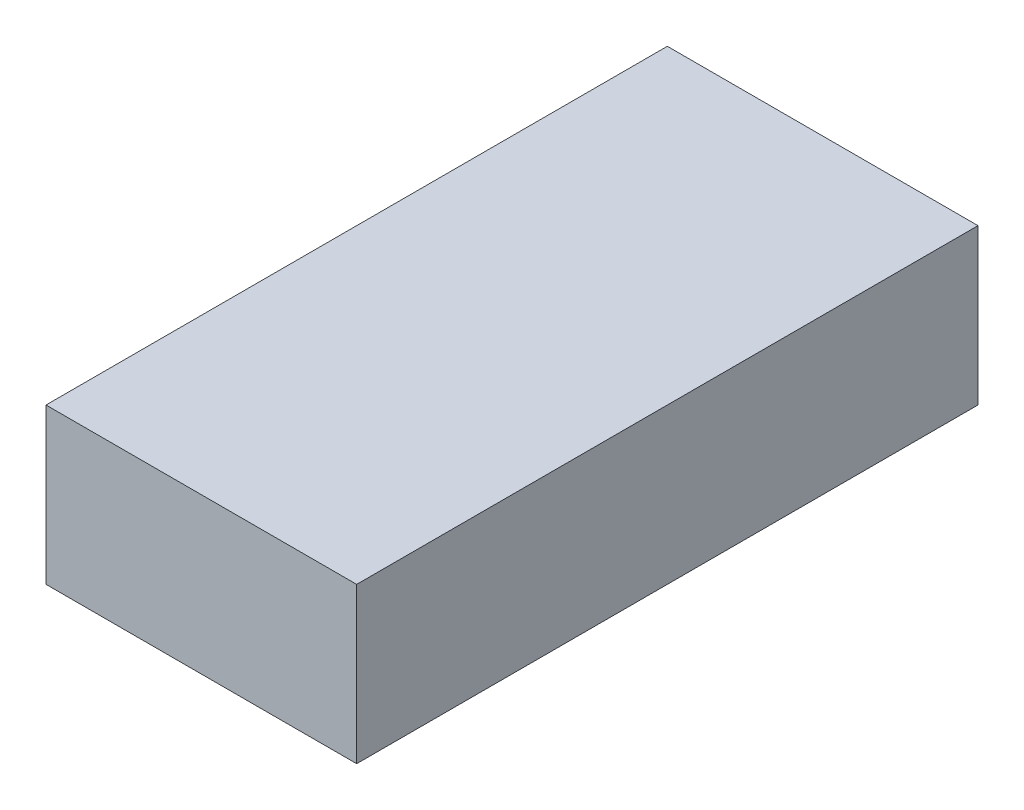
ISO-10303-21;
HEADER;
FILE_DESCRIPTION(('STEP AP214'),'2;1');
FILE_NAME('part.step','',(''),(''),'','','');
FILE_SCHEMA(('AUTOMOTIVE_DESIGN { 1 0 10303 214 1 1 1 1 }'));
ENDSEC;
DATA;
#1=APPLICATION_CONTEXT('core data for automotive mechanical design processes');
#2=APPLICATION_PROTOCOL_DEFINITION('international standard','automotive_design',2000,#1);
#3=PRODUCT_CONTEXT('',#1,'mechanical');
#4=PRODUCT('Part','Part','',(#3));
#5=PRODUCT_RELATED_PRODUCT_CATEGORY('part','',(#4));
#6=PRODUCT_DEFINITION_FORMATION('','',#4);
#7=PRODUCT_DEFINITION_CONTEXT('part definition',#1,'design');
#8=PRODUCT_DEFINITION('design','',#6,#7);
#9=PRODUCT_DEFINITION_SHAPE('','',#8);
#10=(LENGTH_UNIT() NAMED_UNIT(*) SI_UNIT(.MILLI.,.METRE.));
#11=(NAMED_UNIT(*) PLANE_ANGLE_UNIT() SI_UNIT($,.RADIAN.));
#12=(NAMED_UNIT(*) SI_UNIT($,.STERADIAN.) SOLID_ANGLE_UNIT());
#13=UNCERTAINTY_MEASURE_WITH_UNIT(LENGTH_MEASURE(1.E-05),#10,'distance_accuracy_value','');
#14=(GEOMETRIC_REPRESENTATION_CONTEXT(3) GLOBAL_UNCERTAINTY_ASSIGNED_CONTEXT((#13)) GLOBAL_UNIT_ASSIGNED_CONTEXT((#10,
#11,#12)) REPRESENTATION_CONTEXT('',''));
#15=CARTESIAN_POINT('',(0.,0.,0.));
#16=DIRECTION('',(0.,0.,1.));
#17=DIRECTION('',(1.,0.,0.));
#18=AXIS2_PLACEMENT_3D('',#15,#16,#17);
#19=CARTESIAN_POINT('',(0.,152.4,0.));
#20=DIRECTION('',(1.,0.,0.));
#21=DIRECTION('',(0.,0.,-1.));
#22=AXIS2_PLACEMENT_3D('',#19,#20,#21);
#23=PLANE('',#22);
#24=DIRECTION('',(0.,0.,1.));
#25=VECTOR('',#24,1.);
#26=CARTESIAN_POINT('',(0.,0.,0.));
#27=LINE('',#26,#25);
#28=CARTESIAN_POINT('',(0.,0.,-609.6));
#29=VERTEX_POINT('',#28);
#30=CARTESIAN_POINT('',(0.,0.,0.));
#31=VERTEX_POINT('',#30);
#32=EDGE_CURVE('E96',#29,#31,#27,.T.);
#33=ORIENTED_EDGE('',*,*,#32,.T.);
#34=DIRECTION('',(0.,-1.,0.));
#35=VECTOR('',#34,1.);
#36=CARTESIAN_POINT('',(0.,152.4,0.));
#37=LINE('',#36,#35);
#38=CARTESIAN_POINT('',(0.,152.4,0.));
#39=VERTEX_POINT('',#38);
#40=EDGE_CURVE('E11',#39,#31,#37,.T.);
#41=ORIENTED_EDGE('',*,*,#40,.F.);
#42=DIRECTION('',(0.,0.,1.));
#43=VECTOR('',#42,1.);
#44=CARTESIAN_POINT('',(0.,152.4,0.));
#45=LINE('',#44,#43);
#46=CARTESIAN_POINT('',(0.,152.4,-609.6));
#47=VERTEX_POINT('',#46);
#48=EDGE_CURVE('E84',#47,#39,#45,.T.);
#49=ORIENTED_EDGE('',*,*,#48,.F.);
#50=DIRECTION('',(0.,-1.,0.));
#51=VECTOR('',#50,1.);
#52=CARTESIAN_POINT('',(0.,152.4,-609.6));
#53=LINE('',#52,#51);
#54=EDGE_CURVE('E92',#47,#29,#53,.T.);
#55=ORIENTED_EDGE('',*,*,#54,.T.);
#56=EDGE_LOOP('',(#33,#41,#49,#55));
#57=FACE_BOUND('',#56,.T.);
#58=ADVANCED_FACE('F33',(#57),#23,.F.);
#59=CARTESIAN_POINT('',(0.,152.4,0.));
#60=DIRECTION('',(0.,0.,-1.));
#61=DIRECTION('',(-1.,0.,0.));
#62=AXIS2_PLACEMENT_3D('',#59,#60,#61);
#63=PLANE('',#62);
#64=DIRECTION('',(1.,0.,0.));
#65=VECTOR('',#64,1.);
#66=CARTESIAN_POINT('',(0.,0.,0.));
#67=LINE('',#66,#65);
#68=CARTESIAN_POINT('',(304.8,0.,0.));
#69=VERTEX_POINT('',#68);
#70=EDGE_CURVE('E88',#31,#69,#67,.T.);
#71=ORIENTED_EDGE('',*,*,#70,.T.);
#72=DIRECTION('',(0.,-1.,0.));
#73=VECTOR('',#72,1.);
#74=CARTESIAN_POINT('',(304.8,152.4,0.));
#75=LINE('',#74,#73);
#76=CARTESIAN_POINT('',(304.8,152.4,0.));
#77=VERTEX_POINT('',#76);
#78=EDGE_CURVE('E41',#77,#69,#75,.T.);
#79=ORIENTED_EDGE('',*,*,#78,.F.);
#80=DIRECTION('',(1.,0.,0.));
#81=VECTOR('',#80,1.);
#82=CARTESIAN_POINT('',(0.,152.4,0.));
#83=LINE('',#82,#81);
#84=EDGE_CURVE('E79',#39,#77,#83,.T.);
#85=ORIENTED_EDGE('',*,*,#84,.F.);
#86=ORIENTED_EDGE('',*,*,#40,.T.);
#87=EDGE_LOOP('',(#71,#79,#85,#86));
#88=FACE_BOUND('',#87,.T.);
#89=ADVANCED_FACE('F87',(#88),#63,.F.);
#90=CARTESIAN_POINT('',(304.8,152.4,0.));
#91=DIRECTION('',(-1.,0.,0.));
#92=DIRECTION('',(0.,0.,1.));
#93=AXIS2_PLACEMENT_3D('',#90,#91,#92);
#94=PLANE('',#93);
#95=DIRECTION('',(0.,0.,-1.));
#96=VECTOR('',#95,1.);
#97=CARTESIAN_POINT('',(304.8,0.,0.));
#98=LINE('',#97,#96);
#99=CARTESIAN_POINT('',(304.8,0.,-609.6));
#100=VERTEX_POINT('',#99);
#101=EDGE_CURVE('E66',#69,#100,#98,.T.);
#102=ORIENTED_EDGE('',*,*,#101,.T.);
#103=DIRECTION('',(0.,-1.,0.));
#104=VECTOR('',#103,1.);
#105=CARTESIAN_POINT('',(304.8,152.4,-609.6));
#106=LINE('',#105,#104);
#107=CARTESIAN_POINT('',(304.8,152.4,-609.6));
#108=VERTEX_POINT('',#107);
#109=EDGE_CURVE('E89',#108,#100,#106,.T.);
#110=ORIENTED_EDGE('',*,*,#109,.F.);
#111=DIRECTION('',(0.,0.,-1.));
#112=VECTOR('',#111,1.);
#113=CARTESIAN_POINT('',(304.8,152.4,0.));
#114=LINE('',#113,#112);
#115=EDGE_CURVE('E82',#77,#108,#114,.T.);
#116=ORIENTED_EDGE('',*,*,#115,.F.);
#117=ORIENTED_EDGE('',*,*,#78,.T.);
#118=EDGE_LOOP('',(#102,#110,#116,#117));
#119=FACE_BOUND('',#118,.T.);
#120=ADVANCED_FACE('F90',(#119),#94,.F.);
#121=CARTESIAN_POINT('',(0.,152.4,-609.6));
#122=DIRECTION('',(0.,0.,1.));
#123=DIRECTION('',(1.,0.,0.));
#124=AXIS2_PLACEMENT_3D('',#121,#122,#123);
#125=PLANE('',#124);
#126=DIRECTION('',(-1.,0.,0.));
#127=VECTOR('',#126,1.);
#128=CARTESIAN_POINT('',(0.,0.,-609.6));
#129=LINE('',#128,#127);
#130=EDGE_CURVE('E72',#100,#29,#129,.T.);
#131=ORIENTED_EDGE('',*,*,#130,.T.);
#132=ORIENTED_EDGE('',*,*,#54,.F.);
#133=DIRECTION('',(-1.,0.,0.));
#134=VECTOR('',#133,1.);
#135=CARTESIAN_POINT('',(0.,152.4,-609.6));
#136=LINE('',#135,#134);
#137=EDGE_CURVE('E49',#108,#47,#136,.T.);
#138=ORIENTED_EDGE('',*,*,#137,.F.);
#139=ORIENTED_EDGE('',*,*,#109,.T.);
#140=EDGE_LOOP('',(#131,#132,#138,#139));
#141=FACE_BOUND('',#140,.T.);
#142=ADVANCED_FACE('F103',(#141),#125,.F.);
#143=CARTESIAN_POINT('',(0.,152.4,0.));
#144=DIRECTION('',(0.,-1.,0.));
#145=DIRECTION('',(0.,0.,-1.));
#146=AXIS2_PLACEMENT_3D('',#143,#144,#145);
#147=PLANE('',#146);
#148=ORIENTED_EDGE('',*,*,#48,.T.);
#149=ORIENTED_EDGE('',*,*,#84,.T.);
#150=ORIENTED_EDGE('',*,*,#115,.T.);
#151=ORIENTED_EDGE('',*,*,#137,.T.);
#152=EDGE_LOOP('',(#148,#149,#150,#151));
#153=FACE_BOUND('',#152,.T.);
#154=ADVANCED_FACE('F80',(#153),#147,.F.);
#155=CARTESIAN_POINT('',(0.,0.,0.));
#156=DIRECTION('',(0.,-1.,0.));
#157=DIRECTION('',(0.,0.,-1.));
#158=AXIS2_PLACEMENT_3D('',#155,#156,#157);
#159=PLANE('',#158);
#160=ORIENTED_EDGE('',*,*,#32,.F.);
#161=ORIENTED_EDGE('',*,*,#130,.F.);
#162=ORIENTED_EDGE('',*,*,#101,.F.);
#163=ORIENTED_EDGE('',*,*,#70,.F.);
#164=EDGE_LOOP('',(#160,#161,#162,#163));
#165=FACE_BOUND('',#164,.T.);
#166=ADVANCED_FACE('F106',(#165),#159,.T.);
#167=CLOSED_SHELL('',(#58,#89,#120,#142,#154,#166));
#168=MANIFOLD_SOLID_BREP('B2',#167);
#169=ADVANCED_BREP_SHAPE_REPRESENTATION('',(#18,#168),#14);
#170=SHAPE_DEFINITION_REPRESENTATION(#9,#169);
ENDSEC;
END-ISO-10303-21;
